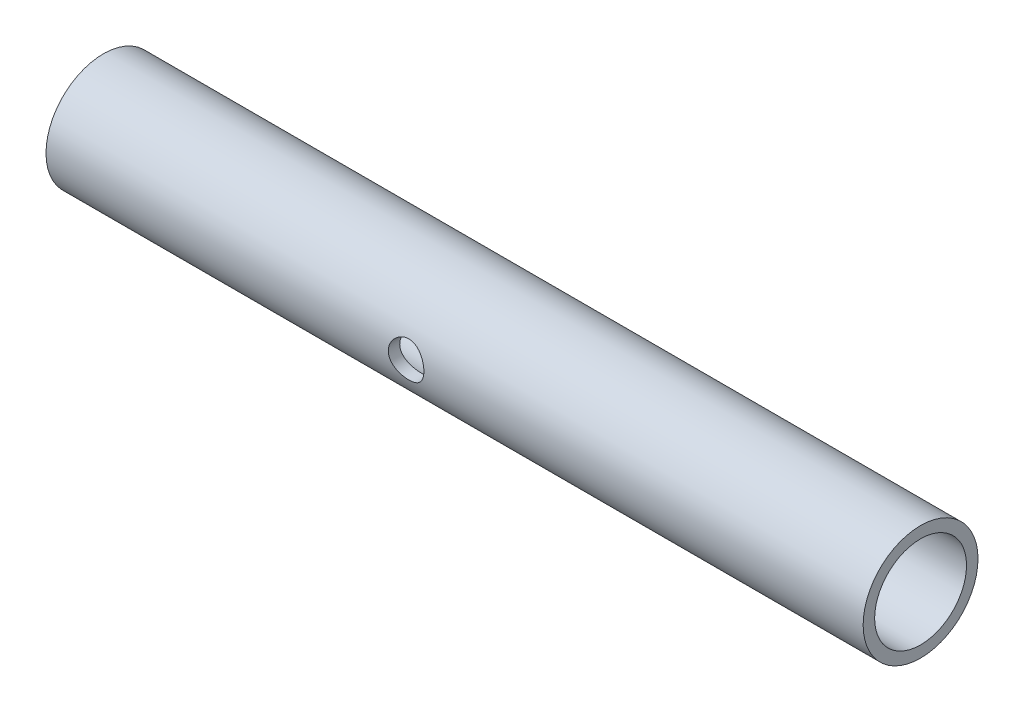
ISO-10303-21;
HEADER;
FILE_DESCRIPTION(('STEP AP214'),'2;1');
FILE_NAME('part.step','',(''),(''),'','','');
FILE_SCHEMA(('AUTOMOTIVE_DESIGN { 1 0 10303 214 1 1 1 1 }'));
ENDSEC;
DATA;
#1=APPLICATION_CONTEXT('core data for automotive mechanical design processes');
#2=APPLICATION_PROTOCOL_DEFINITION('international standard','automotive_design',2000,#1);
#3=PRODUCT_CONTEXT('',#1,'mechanical');
#4=PRODUCT('Part','Part','',(#3));
#5=PRODUCT_RELATED_PRODUCT_CATEGORY('part','',(#4));
#6=PRODUCT_DEFINITION_FORMATION('','',#4);
#7=PRODUCT_DEFINITION_CONTEXT('part definition',#1,'design');
#8=PRODUCT_DEFINITION('design','',#6,#7);
#9=PRODUCT_DEFINITION_SHAPE('','',#8);
#10=(LENGTH_UNIT() NAMED_UNIT(*) SI_UNIT(.MILLI.,.METRE.));
#11=(NAMED_UNIT(*) PLANE_ANGLE_UNIT() SI_UNIT($,.RADIAN.));
#12=(NAMED_UNIT(*) SI_UNIT($,.STERADIAN.) SOLID_ANGLE_UNIT());
#13=UNCERTAINTY_MEASURE_WITH_UNIT(LENGTH_MEASURE(1.E-05),#10,'distance_accuracy_value','');
#14=(GEOMETRIC_REPRESENTATION_CONTEXT(3) GLOBAL_UNCERTAINTY_ASSIGNED_CONTEXT((#13)) GLOBAL_UNIT_ASSIGNED_CONTEXT((#10,
#11,#12)) REPRESENTATION_CONTEXT('',''));
#15=CARTESIAN_POINT('',(0.,0.,0.));
#16=DIRECTION('',(0.,0.,1.));
#17=DIRECTION('',(1.,0.,0.));
#18=AXIS2_PLACEMENT_3D('',#15,#16,#17);
#19=CARTESIAN_POINT('',(107.,0.,0.));
#20=DIRECTION('',(1.,0.,0.));
#21=DIRECTION('',(0.,0.,-1.));
#22=AXIS2_PLACEMENT_3D('',#19,#20,#21);
#23=PLANE('',#22);
#24=CARTESIAN_POINT('',(107.,0.,0.));
#25=DIRECTION('',(1.,0.,0.));
#26=DIRECTION('',(0.,0.,-1.));
#27=AXIS2_PLACEMENT_3D('',#24,#25,#26);
#28=CIRCLE('',#27,10.);
#29=CARTESIAN_POINT('',(107.,0.,-10.));
#30=VERTEX_POINT('',#29);
#31=EDGE_CURVE('E10',#30,#30,#28,.T.);
#32=ORIENTED_EDGE('',*,*,#31,.T.);
#33=EDGE_LOOP('',(#32));
#34=FACE_BOUND('',#33,.T.);
#35=CARTESIAN_POINT('',(107.,0.,0.));
#36=DIRECTION('',(1.,0.,0.));
#37=DIRECTION('',(0.,0.,-1.));
#38=AXIS2_PLACEMENT_3D('',#35,#36,#37);
#39=CIRCLE('',#38,8.);
#40=CARTESIAN_POINT('',(107.,0.,-8.));
#41=VERTEX_POINT('',#40);
#42=EDGE_CURVE('E48',#41,#41,#39,.T.);
#43=ORIENTED_EDGE('',*,*,#42,.F.);
#44=EDGE_LOOP('',(#43));
#45=FACE_BOUND('',#44,.T.);
#46=ADVANCED_FACE('F34',(#34,#45),#23,.T.);
#47=CARTESIAN_POINT('',(107.,0.,0.));
#48=DIRECTION('',(-1.,0.,0.));
#49=DIRECTION('',(0.,0.,1.));
#50=AXIS2_PLACEMENT_3D('',#47,#48,#49);
#51=CYLINDRICAL_SURFACE('',#50,10.);
#52=CARTESIAN_POINT('',(30.5,0.,-10.));
#53=CARTESIAN_POINT('',(30.4999986914706,0.169796920855892,-9.99999902073557));
#54=CARTESIAN_POINT('',(30.4860034913031,0.339607336684761,-9.99563442375018));
#55=CARTESIAN_POINT('',(30.4305363776787,0.674266441555786,-9.97865054414503));
#56=CARTESIAN_POINT('',(30.3890578464894,0.839113925572721,-9.96602927340371));
#57=CARTESIAN_POINT('',(30.2801541759854,1.15897272927845,-9.93391167397765));
#58=CARTESIAN_POINT('',(30.2127688192329,1.31399870780976,-9.91442589027061));
#59=CARTESIAN_POINT('',(30.0541323402715,1.61055112364306,-9.87059390489131));
#60=CARTESIAN_POINT('',(29.9628775737812,1.75207549506966,-9.84624696117201));
#61=CARTESIAN_POINT('',(29.756167491526,2.02191665750164,-9.79445053429251));
#62=CARTESIAN_POINT('',(29.6401169636409,2.14976462458016,-9.76693426248667));
#63=CARTESIAN_POINT('',(29.3883771909521,2.38453104148638,-9.7122896138575));
#64=CARTESIAN_POINT('',(29.2526843709556,2.49144567277949,-9.68516130863978));
#65=CARTESIAN_POINT('',(28.9614718361095,2.68383734587671,-9.63364954531737));
#66=CARTESIAN_POINT('',(28.8055510095918,2.76873144192815,-9.609348635187));
#67=CARTESIAN_POINT('',(28.4807706394713,2.91089923867892,-9.56724635351237));
#68=CARTESIAN_POINT('',(28.3119144557012,2.96818008364982,-9.54944330109188));
#69=CARTESIAN_POINT('',(27.9713417664029,3.05178495406996,-9.52305054549581));
#70=CARTESIAN_POINT('',(27.7998590202052,3.07897757392956,-9.51420299743532));
#71=CARTESIAN_POINT('',(27.4545546107252,3.10434744264988,-9.50595714202736));
#72=CARTESIAN_POINT('',(27.2807335697527,3.10253226471091,-9.50655636836613));
#73=CARTESIAN_POINT('',(26.9428468385409,3.07061800700967,-9.51690857154057));
#74=CARTESIAN_POINT('',(26.7786644166293,3.04161982654159,-9.52630523759645));
#75=CARTESIAN_POINT('',(26.457620419745,2.95794639851261,-9.55261520285249));
#76=CARTESIAN_POINT('',(26.3007596134031,2.90326846169922,-9.56952928928697));
#77=CARTESIAN_POINT('',(25.9961747569165,2.76900342399107,-9.60924366073289));
#78=CARTESIAN_POINT('',(25.8486151710353,2.68906833995311,-9.63212534527812));
#79=CARTESIAN_POINT('',(25.5686411959129,2.5067997800713,-9.68115905879403));
#80=CARTESIAN_POINT('',(25.4362307012866,2.4044605640586,-9.70731192513767));
#81=CARTESIAN_POINT('',(25.1840855783746,2.17487334538022,-9.76137382843075));
#82=CARTESIAN_POINT('',(25.0651834765258,2.0467155374126,-9.78930907837817));
#83=CARTESIAN_POINT('',(24.8503581213205,1.77193162064485,-9.84275484470535));
#84=CARTESIAN_POINT('',(24.7544365165874,1.62530418798238,-9.86826518704281));
#85=CARTESIAN_POINT('',(24.5877429051478,1.31615737091425,-9.91424741310582));
#86=CARTESIAN_POINT('',(24.5171666478707,1.15352615362243,-9.93467972030204));
#87=CARTESIAN_POINT('',(24.404619225927,0.817919686324558,-9.96791813365005));
#88=CARTESIAN_POINT('',(24.3626395194925,0.644947541952469,-9.98072651691769));
#89=CARTESIAN_POINT('',(24.3098884920915,0.300638148558493,-9.99690877528752));
#90=CARTESIAN_POINT('',(24.2979898770825,0.129489365513027,-10.0006232685849));
#91=CARTESIAN_POINT('',(24.3025641983139,-0.212376219031704,-9.99920497500667));
#92=CARTESIAN_POINT('',(24.3190330631133,-0.383093079000957,-9.99407345775425));
#93=CARTESIAN_POINT('',(24.3789685084504,-0.71491959466644,-9.97576338237303));
#94=CARTESIAN_POINT('',(24.4217667632179,-0.876162017891075,-9.96278416046779));
#95=CARTESIAN_POINT('',(24.5323329260942,-1.18913446446705,-9.93029379265401));
#96=CARTESIAN_POINT('',(24.6001039028543,-1.34086331610715,-9.9107818440301));
#97=CARTESIAN_POINT('',(24.7605220010388,-1.63457371739726,-9.86664943350378));
#98=CARTESIAN_POINT('',(24.8537300414079,-1.77623162648863,-9.84191704144451));
#99=CARTESIAN_POINT('',(25.0617017315681,-2.04227505065869,-9.79017420669189));
#100=CARTESIAN_POINT('',(25.1764711387553,-2.16665593689705,-9.76316315660666));
#101=CARTESIAN_POINT('',(25.4296088975362,-2.39964211637346,-9.70858418694528));
#102=CARTESIAN_POINT('',(25.5687223378286,-2.50744420520635,-9.68103555865981));
#103=CARTESIAN_POINT('',(25.8636635955241,-2.69824263692462,-9.6296046302432));
#104=CARTESIAN_POINT('',(26.019491108948,-2.78123943084052,-9.60572226345288));
#105=CARTESIAN_POINT('',(26.3430772758035,-2.91954365006883,-9.56459521120936));
#106=CARTESIAN_POINT('',(26.5107844248371,-2.97496313967633,-9.54732372869111));
#107=CARTESIAN_POINT('',(26.8537933725319,-3.05658418408721,-9.52151044789343));
#108=CARTESIAN_POINT('',(27.0290923151987,-3.08279662892951,-9.51296539600616));
#109=CARTESIAN_POINT('',(27.3739229136942,-3.10448580741133,-9.50590778775765));
#110=CARTESIAN_POINT('',(27.5433640430238,-3.10127847417601,-9.50696567365777));
#111=CARTESIAN_POINT('',(27.8791679854871,-3.06738863255875,-9.51795340966393));
#112=CARTESIAN_POINT('',(28.0455309376173,-3.03670736788091,-9.52788285816744));
#113=CARTESIAN_POINT('',(28.3681440632459,-2.94961523274471,-9.55519716100731));
#114=CARTESIAN_POINT('',(28.5245041501887,-2.89357520590321,-9.57247435099066));
#115=CARTESIAN_POINT('',(28.8257273816266,-2.75764759447982,-9.61251146789651));
#116=CARTESIAN_POINT('',(28.9705882071099,-2.67775521507416,-9.63527249700809));
#117=CARTESIAN_POINT('',(29.250750024278,-2.49278489522552,-9.68480840625829));
#118=CARTESIAN_POINT('',(29.3854665574816,-2.38685418432441,-9.71170426580514));
#119=CARTESIAN_POINT('',(29.635637752021,-2.15432170013904,-9.76591677924899));
#120=CARTESIAN_POINT('',(29.7510872769607,-2.02771443242891,-9.79323354324163));
#121=CARTESIAN_POINT('',(29.9631361549884,-1.75255504376496,-9.84625677988313));
#122=CARTESIAN_POINT('',(30.0590154584932,-1.60343105987636,-9.87188392696447));
#123=CARTESIAN_POINT('',(30.2242151000046,-1.29038694828327,-9.9176541524624));
#124=CARTESIAN_POINT('',(30.2935462868562,-1.12647289842432,-9.93779947004383));
#125=CARTESIAN_POINT('',(30.398405344969,-0.803593103212461,-9.9688595003439));
#126=CARTESIAN_POINT('',(30.4363949268131,-0.6454880205127,-9.98043679382465));
#127=CARTESIAN_POINT('',(30.4871904272928,-0.324925507538771,-9.99600677336268));
#128=CARTESIAN_POINT('',(30.5000012520567,-0.162468931415853,-10.0000009370019));
#129=CARTESIAN_POINT('',(30.5,0.,-10.));
#130=B_SPLINE_CURVE_WITH_KNOTS('',3,(#52,#53,#54,#55,#56,#57,#58,#59,#60,#61,#62,#63,#64,#65,
#66,#67,#68,#69,#70,#71,#72,#73,#74,#75,#76,#77,#78,#79,#80,#81,#82,#83,#84,#85,#86,#87,#88,#89,
#90,#91,#92,#93,#94,#95,#96,#97,#98,#99,#100,#101,#102,#103,#104,#105,#106,#107,#108,#109,#110,
#111,#112,#113,#114,#115,#116,#117,#118,#119,#120,#121,#122,#123,#124,#125,#126,#127,#128,#129),
.UNSPECIFIED.,.T.,.F.,(4,2,2,2,2,2,2,2,2,2,2,2,2,2,2,2,2,2,2,2,2,2,2,2,2,2,2,2,2,2,2,2,2,2,2,2,
2,2,4),(0.,0.508793660386022,1.01770987813483,1.52584770479442,2.03406315713354,
2.55622032523606,3.07847265358456,3.61339375403706,4.14817638200768,4.66708171587238,
5.18585157892854,5.68447946031443,6.18315957098776,6.68903412267704,7.19503843662965,
7.72368894251594,8.25237736250054,8.78506537400785,9.3175942021629,9.82984902968712,
10.3420303419877,10.8417185459025,11.3414681720557,11.853279479043,12.3652276465346,
12.8971171300694,13.4289969417581,13.958697364449,14.4882002186917,14.9941383098298,
15.500053499059,15.9987980699051,16.497642966466,17.0157339453742,17.5339628223974,
18.06874783616,18.6033140770697,19.0902444272055,19.5770798886344),.UNSPECIFIED.);
#131=CARTESIAN_POINT('',(30.5,0.,-10.));
#132=VERTEX_POINT('',#131);
#133=EDGE_CURVE('E80',#132,#132,#130,.T.);
#134=ORIENTED_EDGE('',*,*,#133,.T.);
#135=EDGE_LOOP('',(#134));
#136=FACE_BOUND('',#135,.T.);
#137=CARTESIAN_POINT('',(30.5,0.,10.));
#138=CARTESIAN_POINT('',(30.4999986914706,-0.169796920855892,9.99999902073557));
#139=CARTESIAN_POINT('',(30.4860034913031,-0.339607336684761,9.99563442375018));
#140=CARTESIAN_POINT('',(30.4305363776787,-0.674266441555786,9.97865054414503));
#141=CARTESIAN_POINT('',(30.3890578464894,-0.839113925572721,9.96602927340371));
#142=CARTESIAN_POINT('',(30.2801541759854,-1.15897272927845,9.93391167397765));
#143=CARTESIAN_POINT('',(30.2127688192329,-1.31399870780976,9.91442589027061));
#144=CARTESIAN_POINT('',(30.0541323402715,-1.61055112364306,9.87059390489131));
#145=CARTESIAN_POINT('',(29.9628775737812,-1.75207549506966,9.84624696117201));
#146=CARTESIAN_POINT('',(29.756167491526,-2.02191665750164,9.79445053429251));
#147=CARTESIAN_POINT('',(29.6401169636409,-2.14976462458016,9.76693426248667));
#148=CARTESIAN_POINT('',(29.3883771909521,-2.38453104148638,9.7122896138575));
#149=CARTESIAN_POINT('',(29.2526843709556,-2.49144567277949,9.68516130863978));
#150=CARTESIAN_POINT('',(28.9614718361095,-2.68383734587671,9.63364954531737));
#151=CARTESIAN_POINT('',(28.8055510095918,-2.76873144192815,9.609348635187));
#152=CARTESIAN_POINT('',(28.4807706394713,-2.91089923867892,9.56724635351237));
#153=CARTESIAN_POINT('',(28.3119144557012,-2.96818008364982,9.54944330109188));
#154=CARTESIAN_POINT('',(27.9713417664029,-3.05178495406996,9.52305054549581));
#155=CARTESIAN_POINT('',(27.7998590202052,-3.07897757392956,9.51420299743532));
#156=CARTESIAN_POINT('',(27.4545546107252,-3.10434744264988,9.50595714202736));
#157=CARTESIAN_POINT('',(27.2807335697527,-3.10253226471091,9.50655636836613));
#158=CARTESIAN_POINT('',(26.9428468385409,-3.07061800700967,9.51690857154057));
#159=CARTESIAN_POINT('',(26.7786644166293,-3.04161982654159,9.52630523759645));
#160=CARTESIAN_POINT('',(26.457620419745,-2.95794639851261,9.55261520285249));
#161=CARTESIAN_POINT('',(26.3007596134031,-2.90326846169922,9.56952928928697));
#162=CARTESIAN_POINT('',(25.9961747569165,-2.76900342399107,9.60924366073289));
#163=CARTESIAN_POINT('',(25.8486151710353,-2.68906833995311,9.63212534527812));
#164=CARTESIAN_POINT('',(25.5686411959129,-2.5067997800713,9.68115905879403));
#165=CARTESIAN_POINT('',(25.4362307012866,-2.4044605640586,9.70731192513767));
#166=CARTESIAN_POINT('',(25.1840855783746,-2.17487334538022,9.76137382843075));
#167=CARTESIAN_POINT('',(25.0651834765258,-2.0467155374126,9.78930907837817));
#168=CARTESIAN_POINT('',(24.8503581213205,-1.77193162064485,9.84275484470535));
#169=CARTESIAN_POINT('',(24.7544365165874,-1.62530418798238,9.86826518704281));
#170=CARTESIAN_POINT('',(24.5877429051478,-1.31615737091425,9.91424741310582));
#171=CARTESIAN_POINT('',(24.5171666478707,-1.15352615362243,9.93467972030204));
#172=CARTESIAN_POINT('',(24.404619225927,-0.817919686324558,9.96791813365005));
#173=CARTESIAN_POINT('',(24.3626395194925,-0.644947541952469,9.98072651691769));
#174=CARTESIAN_POINT('',(24.3098884920915,-0.300638148558493,9.99690877528752));
#175=CARTESIAN_POINT('',(24.2979898770825,-0.129489365513027,10.0006232685849));
#176=CARTESIAN_POINT('',(24.3025641983139,0.212376219031704,9.99920497500667));
#177=CARTESIAN_POINT('',(24.3190330631133,0.383093079000957,9.99407345775425));
#178=CARTESIAN_POINT('',(24.3789685084504,0.71491959466644,9.97576338237303));
#179=CARTESIAN_POINT('',(24.4217667632179,0.876162017891075,9.96278416046779));
#180=CARTESIAN_POINT('',(24.5323329260942,1.18913446446705,9.93029379265401));
#181=CARTESIAN_POINT('',(24.6001039028543,1.34086331610715,9.9107818440301));
#182=CARTESIAN_POINT('',(24.7605220010388,1.63457371739726,9.86664943350378));
#183=CARTESIAN_POINT('',(24.8537300414079,1.77623162648863,9.84191704144451));
#184=CARTESIAN_POINT('',(25.0617017315681,2.04227505065869,9.79017420669189));
#185=CARTESIAN_POINT('',(25.1764711387553,2.16665593689705,9.76316315660666));
#186=CARTESIAN_POINT('',(25.4296088975362,2.39964211637346,9.70858418694528));
#187=CARTESIAN_POINT('',(25.5687223378286,2.50744420520635,9.68103555865981));
#188=CARTESIAN_POINT('',(25.8636635955241,2.69824263692462,9.6296046302432));
#189=CARTESIAN_POINT('',(26.019491108948,2.78123943084052,9.60572226345288));
#190=CARTESIAN_POINT('',(26.3430772758035,2.91954365006883,9.56459521120936));
#191=CARTESIAN_POINT('',(26.5107844248371,2.97496313967633,9.54732372869111));
#192=CARTESIAN_POINT('',(26.8537933725319,3.05658418408721,9.52151044789343));
#193=CARTESIAN_POINT('',(27.0290923151987,3.08279662892951,9.51296539600616));
#194=CARTESIAN_POINT('',(27.3739229136942,3.10448580741133,9.50590778775765));
#195=CARTESIAN_POINT('',(27.5433640430238,3.10127847417601,9.50696567365777));
#196=CARTESIAN_POINT('',(27.8791679854871,3.06738863255875,9.51795340966393));
#197=CARTESIAN_POINT('',(28.0455309376173,3.03670736788091,9.52788285816744));
#198=CARTESIAN_POINT('',(28.3681440632459,2.94961523274471,9.55519716100731));
#199=CARTESIAN_POINT('',(28.5245041501887,2.89357520590321,9.57247435099066));
#200=CARTESIAN_POINT('',(28.8257273816266,2.75764759447982,9.61251146789651));
#201=CARTESIAN_POINT('',(28.9705882071099,2.67775521507416,9.63527249700809));
#202=CARTESIAN_POINT('',(29.250750024278,2.49278489522552,9.68480840625829));
#203=CARTESIAN_POINT('',(29.3854665574816,2.38685418432441,9.71170426580514));
#204=CARTESIAN_POINT('',(29.635637752021,2.15432170013904,9.76591677924899));
#205=CARTESIAN_POINT('',(29.7510872769607,2.02771443242891,9.79323354324163));
#206=CARTESIAN_POINT('',(29.9631361549884,1.75255504376496,9.84625677988313));
#207=CARTESIAN_POINT('',(30.0590154584932,1.60343105987636,9.87188392696447));
#208=CARTESIAN_POINT('',(30.2242151000046,1.29038694828327,9.9176541524624));
#209=CARTESIAN_POINT('',(30.2935462868562,1.12647289842432,9.93779947004383));
#210=CARTESIAN_POINT('',(30.398405344969,0.803593103212461,9.9688595003439));
#211=CARTESIAN_POINT('',(30.4363949268131,0.6454880205127,9.98043679382465));
#212=CARTESIAN_POINT('',(30.4871904272928,0.324925507538771,9.99600677336268));
#213=CARTESIAN_POINT('',(30.5000012520567,0.162468931415853,10.0000009370019));
#214=CARTESIAN_POINT('',(30.5,0.,10.));
#215=B_SPLINE_CURVE_WITH_KNOTS('',3,(#137,#138,#139,#140,#141,#142,#143,#144,#145,#146,#147,
#148,#149,#150,#151,#152,#153,#154,#155,#156,#157,#158,#159,#160,#161,#162,#163,#164,#165,#166,
#167,#168,#169,#170,#171,#172,#173,#174,#175,#176,#177,#178,#179,#180,#181,#182,#183,#184,#185,
#186,#187,#188,#189,#190,#191,#192,#193,#194,#195,#196,#197,#198,#199,#200,#201,#202,#203,#204,
#205,#206,#207,#208,#209,#210,#211,#212,#213,#214),.UNSPECIFIED.,.T.,.F.,(4,2,2,2,2,2,2,2,2,2,2,
2,2,2,2,2,2,2,2,2,2,2,2,2,2,2,2,2,2,2,2,2,2,2,2,2,2,2,4),(0.,0.508793660386022,1.01770987813483,
1.52584770479442,2.03406315713354,2.55622032523606,3.07847265358456,3.61339375403706,
4.14817638200768,4.66708171587238,5.18585157892854,5.68447946031443,6.18315957098776,
6.68903412267704,7.19503843662965,7.72368894251594,8.25237736250054,8.78506537400785,
9.3175942021629,9.82984902968712,10.3420303419877,10.8417185459025,11.3414681720557,
11.853279479043,12.3652276465346,12.8971171300694,13.4289969417581,13.958697364449,
14.4882002186917,14.9941383098298,15.500053499059,15.9987980699051,16.497642966466,
17.0157339453742,17.5339628223974,18.06874783616,18.6033140770697,19.0902444272055,
19.5770798886344),.UNSPECIFIED.);
#216=CARTESIAN_POINT('',(30.5,0.,10.));
#217=VERTEX_POINT('',#216);
#218=EDGE_CURVE('E75',#217,#217,#215,.T.);
#219=ORIENTED_EDGE('',*,*,#218,.T.);
#220=EDGE_LOOP('',(#219));
#221=FACE_BOUND('',#220,.T.);
#222=ORIENTED_EDGE('',*,*,#31,.F.);
#223=EDGE_LOOP('',(#222));
#224=FACE_BOUND('',#223,.T.);
#225=CARTESIAN_POINT('',(-35.3,0.,0.));
#226=DIRECTION('',(-1.,0.,0.));
#227=DIRECTION('',(0.,0.,1.));
#228=AXIS2_PLACEMENT_3D('',#225,#226,#227);
#229=CIRCLE('',#228,10.);
#230=CARTESIAN_POINT('',(-35.3,0.,10.));
#231=VERTEX_POINT('',#230);
#232=EDGE_CURVE('E53',#231,#231,#229,.T.);
#233=ORIENTED_EDGE('',*,*,#232,.F.);
#234=EDGE_LOOP('',(#233));
#235=FACE_BOUND('',#234,.T.);
#236=ADVANCED_FACE('F36',(#136,#221,#224,#235),#51,.T.);
#237=CARTESIAN_POINT('',(107.,0.,0.));
#238=DIRECTION('',(-1.,0.,0.));
#239=DIRECTION('',(0.,0.,1.));
#240=AXIS2_PLACEMENT_3D('',#237,#238,#239);
#241=CYLINDRICAL_SURFACE('',#240,8.);
#242=CARTESIAN_POINT('',(30.5,0.,8.));
#243=CARTESIAN_POINT('',(30.499988514802,-0.167366219601997,7.99999140435328));
#244=CARTESIAN_POINT('',(30.4863801010795,-0.334882888677823,7.99469171455132));
#245=CARTESIAN_POINT('',(30.4324980934858,-0.664781864729652,7.97404869754053));
#246=CARTESIAN_POINT('',(30.3922302811806,-0.827165276945638,7.95870754800949));
#247=CARTESIAN_POINT('',(30.2867048428722,-1.1421295045611,7.91963865513018));
#248=CARTESIAN_POINT('',(30.2214974087034,-1.29472929422945,7.89592776351016));
#249=CARTESIAN_POINT('',(30.0682019551654,-1.5867982363411,7.84245840272323));
#250=CARTESIAN_POINT('',(29.9801073868881,-1.7262636149254,7.81269820314288));
#251=CARTESIAN_POINT('',(29.7794170695659,-1.99437627495962,7.7486921430767));
#252=CARTESIAN_POINT('',(29.6659741627509,-2.12235748381439,7.71431350434518));
#253=CARTESIAN_POINT('',(29.4196054297569,-2.35802280872533,7.64557557264749));
#254=CARTESIAN_POINT('',(29.2866730651316,-2.46570008526577,7.61121629007362));
#255=CARTESIAN_POINT('',(28.9984228826444,-2.66208253934574,7.54483414540721));
#256=CARTESIAN_POINT('',(28.842407957393,-2.74982214168716,7.51296607992401));
#257=CARTESIAN_POINT('',(28.5164097265854,-2.89751812514655,7.45725595917531));
#258=CARTESIAN_POINT('',(28.346432468771,-2.95748646136802,7.43341045153329));
#259=CARTESIAN_POINT('',(28.0050216274309,-3.0452671868325,7.39787239395326));
#260=CARTESIAN_POINT('',(27.8339682365451,-3.07435689962566,7.38569929953814));
#261=CARTESIAN_POINT('',(27.4890079230111,-3.10354694902627,7.37348441818547));
#262=CARTESIAN_POINT('',(27.315102319068,-3.1036603247463,7.37343717471502));
#263=CARTESIAN_POINT('',(26.9813436099229,-3.07586671091599,7.38506721778625));
#264=CARTESIAN_POINT('',(26.8213084219991,-3.04976927326533,7.39598733473746));
#265=CARTESIAN_POINT('',(26.5080971112101,-2.97329904089292,7.42705715946573));
#266=CARTESIAN_POINT('',(26.354922098575,-2.92292233229135,7.4472083552901));
#267=CARTESIAN_POINT('',(26.0562238175518,-2.79838753315747,7.49490039899831));
#268=CARTESIAN_POINT('',(25.9109105773857,-2.72378074989176,7.52257892696117));
#269=CARTESIAN_POINT('',(25.6343557940135,-2.55321735711012,7.58216506185012));
#270=CARTESIAN_POINT('',(25.5031193585584,-2.45725303661368,7.61407419451827));
#271=CARTESIAN_POINT('',(25.2484810300031,-2.2385531734497,7.68133243028075));
#272=CARTESIAN_POINT('',(25.1263275400641,-2.11438565387799,7.71676362149113));
#273=CARTESIAN_POINT('',(24.9041920185662,-1.84693436859851,7.78510541657201));
#274=CARTESIAN_POINT('',(24.8042138717911,-1.70364726045938,7.81801557813633));
#275=CARTESIAN_POINT('',(24.6277632566649,-1.39866464305596,7.87834281743725));
#276=CARTESIAN_POINT('',(24.5517330508173,-1.23669072225113,7.90565361492339));
#277=CARTESIAN_POINT('',(24.4284224627991,-0.900927155048403,7.95090937582805));
#278=CARTESIAN_POINT('',(24.3811284094834,-0.727143171077729,7.96885879232112));
#279=CARTESIAN_POINT('',(24.3190939987594,-0.383178621072872,7.99257232453076));
#280=CARTESIAN_POINT('',(24.302674229117,-0.213344002418322,7.99896428947225));
#281=CARTESIAN_POINT('',(24.2979304347482,0.126756045843521,8.00080141310437));
#282=CARTESIAN_POINT('',(24.3095996709937,0.29702136232852,7.99624919748955));
#283=CARTESIAN_POINT('',(24.3594460636717,0.625717949244816,7.97712231702595));
#284=CARTESIAN_POINT('',(24.396500353991,0.784346866540206,7.96297244211469));
#285=CARTESIAN_POINT('',(24.4945622757583,1.09300743072615,7.9265064936517));
#286=CARTESIAN_POINT('',(24.5555730095298,1.24303796125377,7.904189362478));
#287=CARTESIAN_POINT('',(24.7017895018733,1.53530569905475,7.85274012348232));
#288=CARTESIAN_POINT('',(24.7876673065093,1.67717317480584,7.8234233571289));
#289=CARTESIAN_POINT('',(24.9804278825829,1.94497176850606,7.76118655245856));
#290=CARTESIAN_POINT('',(25.0873187583211,2.07089670684932,7.72826512607711));
#291=CARTESIAN_POINT('',(25.3268553935979,2.31141260107262,7.65989340145467));
#292=CARTESIAN_POINT('',(25.4606869165664,2.42481711970808,7.62441284438382));
#293=CARTESIAN_POINT('',(25.7461460293493,2.62782085677557,7.55685355505742));
#294=CARTESIAN_POINT('',(25.897775832752,2.71741710961951,7.5247752468891));
#295=CARTESIAN_POINT('',(26.2162656888762,2.87057252879165,7.46770195267302));
#296=CARTESIAN_POINT('',(26.383221385725,2.93395238204099,7.44275609731288));
#297=CARTESIAN_POINT('',(26.7266836510042,3.0312449389318,7.40367178444184));
#298=CARTESIAN_POINT('',(26.9031836698103,3.0651775843123,7.38952601386223));
#299=CARTESIAN_POINT('',(27.2477721110081,3.10076830991624,7.37465748541026));
#300=CARTESIAN_POINT('',(27.4156146645278,3.10446720532594,7.37308610500552));
#301=CARTESIAN_POINT('',(27.7494012588619,3.08477857889966,7.38134497934146));
#302=CARTESIAN_POINT('',(27.9153455044817,3.06139400742814,7.39117399216909));
#303=CARTESIAN_POINT('',(28.2347317817077,2.98983092491714,7.42039855804592));
#304=CARTESIAN_POINT('',(28.3884079405426,2.94254398824373,7.43944912704243));
#305=CARTESIAN_POINT('',(28.6857215745452,2.82532693235599,7.4847481727208));
#306=CARTESIAN_POINT('',(28.8293564232453,2.75539091565132,7.51099852384815));
#307=CARTESIAN_POINT('',(29.1110910793071,2.59041734861614,7.56953043053462));
#308=CARTESIAN_POINT('',(29.2484542651515,2.49421265025074,7.60206395539798));
#309=CARTESIAN_POINT('',(29.5057375785692,2.28117915248753,7.66868039835524));
#310=CARTESIAN_POINT('',(29.6256519526882,2.16434357838515,7.70276382266235));
#311=CARTESIAN_POINT('',(29.8519004925047,1.90512837110569,7.7710675253009));
#312=CARTESIAN_POINT('',(29.9570065693792,1.76164436219855,7.80517590983813));
#313=CARTESIAN_POINT('',(30.1416420668972,1.45772243969103,7.86759274661501));
#314=CARTESIAN_POINT('',(30.2211664757301,1.29728121210155,7.89590006194938));
#315=CARTESIAN_POINT('',(30.3214266287538,1.04139997303361,7.93244589437091));
#316=CARTESIAN_POINT('',(30.3523303779937,0.950278144910817,7.9439065739441));
#317=CARTESIAN_POINT('',(30.4055968849637,0.765269214554198,7.96385559668254));
#318=CARTESIAN_POINT('',(30.4279634751002,0.671383373546591,7.97234527341459));
#319=CARTESIAN_POINT('',(30.4638628341323,0.481722095124671,7.98604900066146));
#320=CARTESIAN_POINT('',(30.4773976868677,0.385947108950744,7.99126382386383));
#321=CARTESIAN_POINT('',(30.4954688999109,0.193464746156209,7.99824154357188));
#322=CARTESIAN_POINT('',(30.500006639806,0.0967575147685113,8.00000496930275));
#323=CARTESIAN_POINT('',(30.5,0.,8.));
#324=B_SPLINE_CURVE_WITH_KNOTS('',3,(#242,#243,#244,#245,#246,#247,#248,#249,#250,#251,#252,
#253,#254,#255,#256,#257,#258,#259,#260,#261,#262,#263,#264,#265,#266,#267,#268,#269,#270,#271,
#272,#273,#274,#275,#276,#277,#278,#279,#280,#281,#282,#283,#284,#285,#286,#287,#288,#289,#290,
#291,#292,#293,#294,#295,#296,#297,#298,#299,#300,#301,#302,#303,#304,#305,#306,#307,#308,#309,
#310,#311,#312,#313,#314,#315,#316,#317,#318,#319,#320,#321,#322,#323),.UNSPECIFIED.,.T.,.F.,(4,
2,2,2,2,2,2,2,2,2,2,2,2,2,2,2,2,2,2,2,2,2,2,2,2,2,2,2,2,2,2,2,2,2,2,2,2,2,2,2,4),(0.,
0.501737013318966,1.00336525164561,1.50398921360972,2.00475658183058,2.52578649169845,
3.04699160166212,3.58969186608898,4.13215828871797,4.6511881116675,5.1699843750685,
5.65526807747953,6.14063003502885,6.63554806092016,7.13064506400891,7.66146282744568,
8.19237350878614,8.73258092298443,9.2725311333558,9.78215061332003,10.2916478391296,
10.7799510498191,11.2683175159082,11.7713612597867,12.2745993990703,12.8090322311655,
13.343531601727,13.881628651635,14.4193610155784,14.9204682891999,15.4215209793352,
15.9051289646317,16.3888629757819,16.8991501441865,17.4096051918234,17.9503505041869,
18.4912016917753,18.7815086164232,19.0716850660218,19.3617930239899,19.6518564943339),.UNSPECIFIED.);
#325=CARTESIAN_POINT('',(30.5,0.,8.));
#326=VERTEX_POINT('',#325);
#327=EDGE_CURVE('E39',#326,#326,#324,.T.);
#328=ORIENTED_EDGE('',*,*,#327,.F.);
#329=EDGE_LOOP('',(#328));
#330=FACE_BOUND('',#329,.T.);
#331=CARTESIAN_POINT('',(30.5,0.,-8.));
#332=CARTESIAN_POINT('',(30.499988514802,0.167366219601997,-7.99999140435328));
#333=CARTESIAN_POINT('',(30.4863801010795,0.334882888677823,-7.99469171455132));
#334=CARTESIAN_POINT('',(30.4324980934858,0.664781864729652,-7.97404869754053));
#335=CARTESIAN_POINT('',(30.3922302811806,0.827165276945638,-7.95870754800949));
#336=CARTESIAN_POINT('',(30.2867048428722,1.1421295045611,-7.91963865513018));
#337=CARTESIAN_POINT('',(30.2214974087034,1.29472929422945,-7.89592776351016));
#338=CARTESIAN_POINT('',(30.0682019551654,1.5867982363411,-7.84245840272323));
#339=CARTESIAN_POINT('',(29.9801073868881,1.7262636149254,-7.81269820314288));
#340=CARTESIAN_POINT('',(29.7794170695659,1.99437627495962,-7.7486921430767));
#341=CARTESIAN_POINT('',(29.6659741627509,2.12235748381439,-7.71431350434518));
#342=CARTESIAN_POINT('',(29.4196054297569,2.35802280872533,-7.64557557264749));
#343=CARTESIAN_POINT('',(29.2866730651316,2.46570008526577,-7.61121629007362));
#344=CARTESIAN_POINT('',(28.9984228826444,2.66208253934574,-7.54483414540721));
#345=CARTESIAN_POINT('',(28.842407957393,2.74982214168716,-7.51296607992401));
#346=CARTESIAN_POINT('',(28.5164097265854,2.89751812514655,-7.45725595917531));
#347=CARTESIAN_POINT('',(28.346432468771,2.95748646136802,-7.43341045153329));
#348=CARTESIAN_POINT('',(28.0050216274309,3.0452671868325,-7.39787239395326));
#349=CARTESIAN_POINT('',(27.8339682365451,3.07435689962566,-7.38569929953814));
#350=CARTESIAN_POINT('',(27.4890079230111,3.10354694902627,-7.37348441818547));
#351=CARTESIAN_POINT('',(27.315102319068,3.1036603247463,-7.37343717471502));
#352=CARTESIAN_POINT('',(26.9813436099229,3.07586671091599,-7.38506721778625));
#353=CARTESIAN_POINT('',(26.8213084219991,3.04976927326533,-7.39598733473746));
#354=CARTESIAN_POINT('',(26.5080971112101,2.97329904089292,-7.42705715946573));
#355=CARTESIAN_POINT('',(26.354922098575,2.92292233229135,-7.4472083552901));
#356=CARTESIAN_POINT('',(26.0562238175518,2.79838753315747,-7.49490039899831));
#357=CARTESIAN_POINT('',(25.9109105773857,2.72378074989176,-7.52257892696117));
#358=CARTESIAN_POINT('',(25.6343557940135,2.55321735711012,-7.58216506185012));
#359=CARTESIAN_POINT('',(25.5031193585584,2.45725303661368,-7.61407419451827));
#360=CARTESIAN_POINT('',(25.2484810300031,2.2385531734497,-7.68133243028075));
#361=CARTESIAN_POINT('',(25.1263275400641,2.11438565387799,-7.71676362149113));
#362=CARTESIAN_POINT('',(24.9041920185662,1.84693436859851,-7.78510541657201));
#363=CARTESIAN_POINT('',(24.8042138717911,1.70364726045938,-7.81801557813633));
#364=CARTESIAN_POINT('',(24.6277632566649,1.39866464305596,-7.87834281743725));
#365=CARTESIAN_POINT('',(24.5517330508173,1.23669072225113,-7.90565361492339));
#366=CARTESIAN_POINT('',(24.4284224627991,0.900927155048403,-7.95090937582805));
#367=CARTESIAN_POINT('',(24.3811284094834,0.727143171077729,-7.96885879232112));
#368=CARTESIAN_POINT('',(24.3190939987594,0.383178621072872,-7.99257232453076));
#369=CARTESIAN_POINT('',(24.302674229117,0.213344002418322,-7.99896428947225));
#370=CARTESIAN_POINT('',(24.2979304347482,-0.126756045843521,-8.00080141310437));
#371=CARTESIAN_POINT('',(24.3095996709937,-0.29702136232852,-7.99624919748955));
#372=CARTESIAN_POINT('',(24.3594460636717,-0.625717949244816,-7.97712231702595));
#373=CARTESIAN_POINT('',(24.396500353991,-0.784346866540206,-7.96297244211469));
#374=CARTESIAN_POINT('',(24.4945622757583,-1.09300743072615,-7.9265064936517));
#375=CARTESIAN_POINT('',(24.5555730095298,-1.24303796125377,-7.904189362478));
#376=CARTESIAN_POINT('',(24.7017895018733,-1.53530569905475,-7.85274012348232));
#377=CARTESIAN_POINT('',(24.7876673065093,-1.67717317480584,-7.8234233571289));
#378=CARTESIAN_POINT('',(24.9804278825829,-1.94497176850606,-7.76118655245856));
#379=CARTESIAN_POINT('',(25.0873187583211,-2.07089670684932,-7.72826512607711));
#380=CARTESIAN_POINT('',(25.3268553935979,-2.31141260107262,-7.65989340145467));
#381=CARTESIAN_POINT('',(25.4606869165664,-2.42481711970808,-7.62441284438382));
#382=CARTESIAN_POINT('',(25.7461460293493,-2.62782085677557,-7.55685355505742));
#383=CARTESIAN_POINT('',(25.897775832752,-2.71741710961951,-7.5247752468891));
#384=CARTESIAN_POINT('',(26.2162656888762,-2.87057252879165,-7.46770195267302));
#385=CARTESIAN_POINT('',(26.383221385725,-2.93395238204099,-7.44275609731288));
#386=CARTESIAN_POINT('',(26.7266836510042,-3.0312449389318,-7.40367178444184));
#387=CARTESIAN_POINT('',(26.9031836698103,-3.0651775843123,-7.38952601386223));
#388=CARTESIAN_POINT('',(27.2477721110081,-3.10076830991624,-7.37465748541026));
#389=CARTESIAN_POINT('',(27.4156146645278,-3.10446720532594,-7.37308610500552));
#390=CARTESIAN_POINT('',(27.7494012588619,-3.08477857889966,-7.38134497934146));
#391=CARTESIAN_POINT('',(27.9153455044817,-3.06139400742814,-7.39117399216909));
#392=CARTESIAN_POINT('',(28.2347317817077,-2.98983092491714,-7.42039855804592));
#393=CARTESIAN_POINT('',(28.3884079405426,-2.94254398824373,-7.43944912704243));
#394=CARTESIAN_POINT('',(28.6857215745452,-2.82532693235599,-7.4847481727208));
#395=CARTESIAN_POINT('',(28.8293564232453,-2.75539091565132,-7.51099852384815));
#396=CARTESIAN_POINT('',(29.1110910793071,-2.59041734861614,-7.56953043053462));
#397=CARTESIAN_POINT('',(29.2484542651515,-2.49421265025074,-7.60206395539798));
#398=CARTESIAN_POINT('',(29.5057375785692,-2.28117915248753,-7.66868039835524));
#399=CARTESIAN_POINT('',(29.6256519526882,-2.16434357838515,-7.70276382266235));
#400=CARTESIAN_POINT('',(29.8519004925047,-1.90512837110569,-7.7710675253009));
#401=CARTESIAN_POINT('',(29.9570065693792,-1.76164436219855,-7.80517590983813));
#402=CARTESIAN_POINT('',(30.1416420668972,-1.45772243969103,-7.86759274661501));
#403=CARTESIAN_POINT('',(30.2211664757301,-1.29728121210155,-7.89590006194938));
#404=CARTESIAN_POINT('',(30.3214266287538,-1.04139997303361,-7.93244589437091));
#405=CARTESIAN_POINT('',(30.3523303779937,-0.950278144910817,-7.9439065739441));
#406=CARTESIAN_POINT('',(30.4055968849637,-0.765269214554198,-7.96385559668254));
#407=CARTESIAN_POINT('',(30.4279634751002,-0.671383373546591,-7.97234527341459));
#408=CARTESIAN_POINT('',(30.4638628341323,-0.481722095124671,-7.98604900066146));
#409=CARTESIAN_POINT('',(30.4773976868677,-0.385947108950744,-7.99126382386383));
#410=CARTESIAN_POINT('',(30.4954688999109,-0.193464746156209,-7.99824154357188));
#411=CARTESIAN_POINT('',(30.500006639806,-0.0967575147685113,-8.00000496930275));
#412=CARTESIAN_POINT('',(30.5,0.,-8.));
#413=B_SPLINE_CURVE_WITH_KNOTS('',3,(#331,#332,#333,#334,#335,#336,#337,#338,#339,#340,#341,
#342,#343,#344,#345,#346,#347,#348,#349,#350,#351,#352,#353,#354,#355,#356,#357,#358,#359,#360,
#361,#362,#363,#364,#365,#366,#367,#368,#369,#370,#371,#372,#373,#374,#375,#376,#377,#378,#379,
#380,#381,#382,#383,#384,#385,#386,#387,#388,#389,#390,#391,#392,#393,#394,#395,#396,#397,#398,
#399,#400,#401,#402,#403,#404,#405,#406,#407,#408,#409,#410,#411,#412),.UNSPECIFIED.,.T.,.F.,(4,
2,2,2,2,2,2,2,2,2,2,2,2,2,2,2,2,2,2,2,2,2,2,2,2,2,2,2,2,2,2,2,2,2,2,2,2,2,2,2,4),(0.,
0.501737013318966,1.00336525164561,1.50398921360972,2.00475658183058,2.52578649169845,
3.04699160166212,3.58969186608898,4.13215828871797,4.6511881116675,5.1699843750685,
5.65526807747953,6.14063003502885,6.63554806092016,7.13064506400891,7.66146282744568,
8.19237350878614,8.73258092298443,9.2725311333558,9.78215061332003,10.2916478391296,
10.7799510498191,11.2683175159082,11.7713612597867,12.2745993990703,12.8090322311655,
13.343531601727,13.881628651635,14.4193610155784,14.9204682891999,15.4215209793352,
15.9051289646317,16.3888629757819,16.8991501441865,17.4096051918234,17.9503505041869,
18.4912016917753,18.7815086164232,19.0716850660218,19.3617930239899,19.6518564943339),.UNSPECIFIED.);
#414=CARTESIAN_POINT('',(30.5,0.,-8.));
#415=VERTEX_POINT('',#414);
#416=EDGE_CURVE('E56',#415,#415,#413,.T.);
#417=ORIENTED_EDGE('',*,*,#416,.F.);
#418=EDGE_LOOP('',(#417));
#419=FACE_BOUND('',#418,.T.);
#420=ORIENTED_EDGE('',*,*,#42,.T.);
#421=EDGE_LOOP('',(#420));
#422=FACE_BOUND('',#421,.T.);
#423=CARTESIAN_POINT('',(-35.3,0.,0.));
#424=DIRECTION('',(-1.,0.,0.));
#425=DIRECTION('',(0.,0.,1.));
#426=AXIS2_PLACEMENT_3D('',#423,#424,#425);
#427=CIRCLE('',#426,8.);
#428=CARTESIAN_POINT('',(-35.3,0.,8.));
#429=VERTEX_POINT('',#428);
#430=EDGE_CURVE('E86',#429,#429,#427,.T.);
#431=ORIENTED_EDGE('',*,*,#430,.T.);
#432=EDGE_LOOP('',(#431));
#433=FACE_BOUND('',#432,.T.);
#434=ADVANCED_FACE('F61',(#330,#419,#422,#433),#241,.F.);
#435=CARTESIAN_POINT('',(-35.3,0.,0.));
#436=DIRECTION('',(-1.,0.,0.));
#437=DIRECTION('',(0.,0.,1.));
#438=AXIS2_PLACEMENT_3D('',#435,#436,#437);
#439=PLANE('',#438);
#440=ORIENTED_EDGE('',*,*,#232,.T.);
#441=EDGE_LOOP('',(#440));
#442=FACE_BOUND('',#441,.T.);
#443=ORIENTED_EDGE('',*,*,#430,.F.);
#444=EDGE_LOOP('',(#443));
#445=FACE_BOUND('',#444,.T.);
#446=ADVANCED_FACE('F68',(#442,#445),#439,.T.);
#447=CARTESIAN_POINT('',(27.4,0.,-10.));
#448=DIRECTION('',(0.,0.,1.));
#449=DIRECTION('',(1.,0.,0.));
#450=AXIS2_PLACEMENT_3D('',#447,#448,#449);
#451=CYLINDRICAL_SURFACE('',#450,3.1);
#452=ORIENTED_EDGE('',*,*,#416,.T.);
#453=EDGE_LOOP('',(#452));
#454=FACE_BOUND('',#453,.T.);
#455=ORIENTED_EDGE('',*,*,#133,.F.);
#456=EDGE_LOOP('',(#455));
#457=FACE_BOUND('',#456,.T.);
#458=ADVANCED_FACE('F64',(#454,#457),#451,.F.);
#459=ORIENTED_EDGE('',*,*,#327,.T.);
#460=EDGE_LOOP('',(#459));
#461=FACE_BOUND('',#460,.T.);
#462=ORIENTED_EDGE('',*,*,#218,.F.);
#463=EDGE_LOOP('',(#462));
#464=FACE_BOUND('',#463,.T.);
#465=ADVANCED_FACE('F67',(#461,#464),#451,.F.);
#466=CLOSED_SHELL('',(#46,#236,#434,#446,#458,#465));
#467=MANIFOLD_SOLID_BREP('B2',#466);
#468=ADVANCED_BREP_SHAPE_REPRESENTATION('',(#18,#467),#14);
#469=SHAPE_DEFINITION_REPRESENTATION(#9,#468);
ENDSEC;
END-ISO-10303-21;
